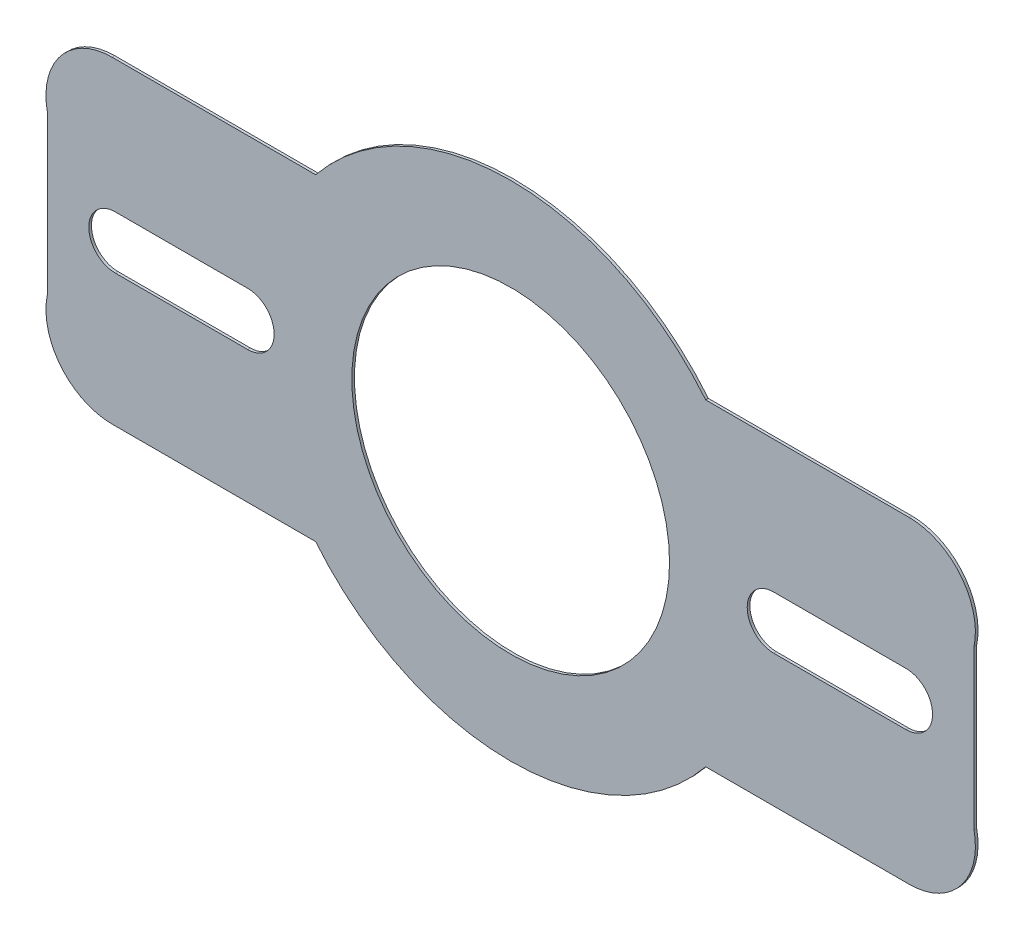
ISO-10303-21;
HEADER;
FILE_DESCRIPTION(('STEP AP214'),'2;1');
FILE_NAME('part.step','',(''),(''),'','','');
FILE_SCHEMA(('AUTOMOTIVE_DESIGN { 1 0 10303 214 1 1 1 1 }'));
ENDSEC;
DATA;
#1=APPLICATION_CONTEXT('core data for automotive mechanical design processes');
#2=APPLICATION_PROTOCOL_DEFINITION('international standard','automotive_design',2000,#1);
#3=PRODUCT_CONTEXT('',#1,'mechanical');
#4=PRODUCT('Part','Part','',(#3));
#5=PRODUCT_RELATED_PRODUCT_CATEGORY('part','',(#4));
#6=PRODUCT_DEFINITION_FORMATION('','',#4);
#7=PRODUCT_DEFINITION_CONTEXT('part definition',#1,'design');
#8=PRODUCT_DEFINITION('design','',#6,#7);
#9=PRODUCT_DEFINITION_SHAPE('','',#8);
#10=(LENGTH_UNIT() NAMED_UNIT(*) SI_UNIT(.MILLI.,.METRE.));
#11=(NAMED_UNIT(*) PLANE_ANGLE_UNIT() SI_UNIT($,.RADIAN.));
#12=(NAMED_UNIT(*) SI_UNIT($,.STERADIAN.) SOLID_ANGLE_UNIT());
#13=UNCERTAINTY_MEASURE_WITH_UNIT(LENGTH_MEASURE(1.E-05),#10,'distance_accuracy_value','');
#14=(GEOMETRIC_REPRESENTATION_CONTEXT(3) GLOBAL_UNCERTAINTY_ASSIGNED_CONTEXT((#13)) GLOBAL_UNIT_ASSIGNED_CONTEXT((#10,
#11,#12)) REPRESENTATION_CONTEXT('',''));
#15=CARTESIAN_POINT('',(0.,0.,0.));
#16=DIRECTION('',(0.,0.,1.));
#17=DIRECTION('',(1.,0.,0.));
#18=AXIS2_PLACEMENT_3D('',#15,#16,#17);
#19=CARTESIAN_POINT('',(0.,0.,1.));
#20=DIRECTION('',(0.,0.,1.));
#21=DIRECTION('',(1.,0.,0.));
#22=AXIS2_PLACEMENT_3D('',#19,#20,#21);
#23=PLANE('',#22);
#24=CARTESIAN_POINT('',(0.,0.,1.));
#25=DIRECTION('',(0.,0.,1.));
#26=DIRECTION('',(1.,0.,0.));
#27=AXIS2_PLACEMENT_3D('',#24,#25,#26);
#28=CIRCLE('',#27,95.);
#29=CARTESIAN_POINT('',(73.6545993132812,60.0000000000001,1.));
#30=VERTEX_POINT('',#29);
#31=CARTESIAN_POINT('',(-73.6545993132812,60.,1.));
#32=VERTEX_POINT('',#31);
#33=EDGE_CURVE('E247',#30,#32,#28,.T.);
#34=ORIENTED_EDGE('',*,*,#33,.T.);
#35=DIRECTION('',(-1.,0.,0.));
#36=VECTOR('',#35,1.);
#37=CARTESIAN_POINT('',(-73.6545993132812,60.,1.));
#38=LINE('',#37,#36);
#39=CARTESIAN_POINT('',(-150.505102572168,60.,1.));
#40=VERTEX_POINT('',#39);
#41=EDGE_CURVE('E250',#32,#40,#38,.T.);
#42=ORIENTED_EDGE('',*,*,#41,.T.);
#43=CARTESIAN_POINT('',(-150.505102572168,35.,1.));
#44=DIRECTION('',(0.,0.,1.));
#45=DIRECTION('',(1.,0.,0.));
#46=AXIS2_PLACEMENT_3D('',#43,#44,#45);
#47=CIRCLE('',#46,25.);
#48=CARTESIAN_POINT('',(-175.,30.,1.));
#49=VERTEX_POINT('',#48);
#50=EDGE_CURVE('E253',#40,#49,#47,.T.);
#51=ORIENTED_EDGE('',*,*,#50,.T.);
#52=DIRECTION('',(0.,-1.,0.));
#53=VECTOR('',#52,1.);
#54=CARTESIAN_POINT('',(-175.,30.,1.));
#55=LINE('',#54,#53);
#56=CARTESIAN_POINT('',(-175.,-30.,1.));
#57=VERTEX_POINT('',#56);
#58=EDGE_CURVE('E255',#49,#57,#55,.T.);
#59=ORIENTED_EDGE('',*,*,#58,.T.);
#60=CARTESIAN_POINT('',(-150.505102572168,-35.,1.));
#61=DIRECTION('',(0.,0.,1.));
#62=DIRECTION('',(-1.,0.,0.));
#63=AXIS2_PLACEMENT_3D('',#60,#61,#62);
#64=CIRCLE('',#63,25.);
#65=CARTESIAN_POINT('',(-150.505102572168,-60.,1.));
#66=VERTEX_POINT('',#65);
#67=EDGE_CURVE('E257',#57,#66,#64,.T.);
#68=ORIENTED_EDGE('',*,*,#67,.T.);
#69=DIRECTION('',(1.,0.,0.));
#70=VECTOR('',#69,1.);
#71=CARTESIAN_POINT('',(-73.6545993132812,-60.,1.));
#72=LINE('',#71,#70);
#73=CARTESIAN_POINT('',(-73.6545993132812,-60.,1.));
#74=VERTEX_POINT('',#73);
#75=EDGE_CURVE('E259',#66,#74,#72,.T.);
#76=ORIENTED_EDGE('',*,*,#75,.T.);
#77=CARTESIAN_POINT('',(0.,0.,1.));
#78=DIRECTION('',(0.,0.,1.));
#79=DIRECTION('',(1.,0.,0.));
#80=AXIS2_PLACEMENT_3D('',#77,#78,#79);
#81=CIRCLE('',#80,95.);
#82=CARTESIAN_POINT('',(73.6545993132812,-59.9999999999999,1.));
#83=VERTEX_POINT('',#82);
#84=EDGE_CURVE('E261',#74,#83,#81,.T.);
#85=ORIENTED_EDGE('',*,*,#84,.T.);
#86=DIRECTION('',(1.,0.,0.));
#87=VECTOR('',#86,1.);
#88=CARTESIAN_POINT('',(73.6545993132812,-59.9999999999999,1.));
#89=LINE('',#88,#87);
#90=CARTESIAN_POINT('',(150.505102572168,-59.9999999999999,1.));
#91=VERTEX_POINT('',#90);
#92=EDGE_CURVE('E263',#83,#91,#89,.T.);
#93=ORIENTED_EDGE('',*,*,#92,.T.);
#94=CARTESIAN_POINT('',(150.505102572168,-34.9999999999999,1.));
#95=DIRECTION('',(0.,0.,1.));
#96=DIRECTION('',(1.,0.,0.));
#97=AXIS2_PLACEMENT_3D('',#94,#95,#96);
#98=CIRCLE('',#97,25.);
#99=CARTESIAN_POINT('',(175.,-29.9999999999999,1.));
#100=VERTEX_POINT('',#99);
#101=EDGE_CURVE('E265',#91,#100,#98,.T.);
#102=ORIENTED_EDGE('',*,*,#101,.T.);
#103=DIRECTION('',(0.,1.,0.));
#104=VECTOR('',#103,1.);
#105=CARTESIAN_POINT('',(175.,30.0000000000001,1.));
#106=LINE('',#105,#104);
#107=CARTESIAN_POINT('',(175.,30.0000000000001,1.));
#108=VERTEX_POINT('',#107);
#109=EDGE_CURVE('E267',#100,#108,#106,.T.);
#110=ORIENTED_EDGE('',*,*,#109,.T.);
#111=CARTESIAN_POINT('',(150.505102572168,35.0000000000001,1.));
#112=DIRECTION('',(0.,0.,1.));
#113=DIRECTION('',(-1.,0.,0.));
#114=AXIS2_PLACEMENT_3D('',#111,#112,#113);
#115=CIRCLE('',#114,25.);
#116=CARTESIAN_POINT('',(150.505102572168,60.0000000000001,1.));
#117=VERTEX_POINT('',#116);
#118=EDGE_CURVE('E269',#108,#117,#115,.T.);
#119=ORIENTED_EDGE('',*,*,#118,.T.);
#120=DIRECTION('',(-1.,0.,0.));
#121=VECTOR('',#120,1.);
#122=CARTESIAN_POINT('',(73.6545993132812,60.0000000000001,1.));
#123=LINE('',#122,#121);
#124=EDGE_CURVE('E271',#117,#30,#123,.T.);
#125=ORIENTED_EDGE('',*,*,#124,.T.);
#126=EDGE_LOOP('',(#34,#42,#51,#59,#68,#76,#85,#93,#102,#110,#119,#125));
#127=FACE_BOUND('',#126,.T.);
#128=CARTESIAN_POINT('',(0.,0.,1.));
#129=DIRECTION('',(0.,0.,1.));
#130=DIRECTION('',(1.,0.,0.));
#131=AXIS2_PLACEMENT_3D('',#128,#129,#130);
#132=CIRCLE('',#131,60.);
#133=CARTESIAN_POINT('',(60.,0.,1.));
#134=VERTEX_POINT('',#133);
#135=EDGE_CURVE('E241',#134,#134,#132,.T.);
#136=ORIENTED_EDGE('',*,*,#135,.F.);
#137=EDGE_LOOP('',(#136));
#138=FACE_BOUND('',#137,.T.);
#139=DIRECTION('',(-1.,0.,0.));
#140=VECTOR('',#139,1.);
#141=CARTESIAN_POINT('',(-149.327299656641,9.99999999999998,1.));
#142=LINE('',#141,#140);
#143=CARTESIAN_POINT('',(-99.3272996566406,9.99999999999998,1.));
#144=VERTEX_POINT('',#143);
#145=CARTESIAN_POINT('',(-149.327299656641,9.99999999999998,1.));
#146=VERTEX_POINT('',#145);
#147=EDGE_CURVE('E212',#144,#146,#142,.T.);
#148=ORIENTED_EDGE('',*,*,#147,.F.);
#149=CARTESIAN_POINT('',(-99.3272996566406,0.,1.));
#150=DIRECTION('',(0.,0.,1.));
#151=DIRECTION('',(-1.,0.,0.));
#152=AXIS2_PLACEMENT_3D('',#149,#150,#151);
#153=CIRCLE('',#152,9.99999999999999);
#154=CARTESIAN_POINT('',(-99.3272996566406,-10.,1.));
#155=VERTEX_POINT('',#154);
#156=EDGE_CURVE('E210',#155,#144,#153,.T.);
#157=ORIENTED_EDGE('',*,*,#156,.F.);
#158=DIRECTION('',(1.,0.,0.));
#159=VECTOR('',#158,1.);
#160=CARTESIAN_POINT('',(-149.327299656641,-10.,1.));
#161=LINE('',#160,#159);
#162=CARTESIAN_POINT('',(-149.327299656641,-10.,1.));
#163=VERTEX_POINT('',#162);
#164=EDGE_CURVE('E218',#163,#155,#161,.T.);
#165=ORIENTED_EDGE('',*,*,#164,.F.);
#166=CARTESIAN_POINT('',(-149.327299656641,0.,1.));
#167=DIRECTION('',(0.,0.,1.));
#168=DIRECTION('',(1.,0.,0.));
#169=AXIS2_PLACEMENT_3D('',#166,#167,#168);
#170=CIRCLE('',#169,9.99999999999999);
#171=EDGE_CURVE('E215',#146,#163,#170,.T.);
#172=ORIENTED_EDGE('',*,*,#171,.F.);
#173=EDGE_LOOP('',(#148,#157,#165,#172));
#174=FACE_BOUND('',#173,.T.);
#175=DIRECTION('',(1.,0.,0.));
#176=VECTOR('',#175,1.);
#177=CARTESIAN_POINT('',(149.327299656641,-9.9999999999999,1.));
#178=LINE('',#177,#176);
#179=CARTESIAN_POINT('',(99.3272996566406,-9.9999999999999,1.));
#180=VERTEX_POINT('',#179);
#181=CARTESIAN_POINT('',(149.327299656641,-9.9999999999999,1.));
#182=VERTEX_POINT('',#181);
#183=EDGE_CURVE('E182',#180,#182,#178,.T.);
#184=ORIENTED_EDGE('',*,*,#183,.F.);
#185=CARTESIAN_POINT('',(99.3272996566406,0.,1.));
#186=DIRECTION('',(0.,0.,1.));
#187=DIRECTION('',(1.,0.,0.));
#188=AXIS2_PLACEMENT_3D('',#185,#186,#187);
#189=CIRCLE('',#188,9.99999999999999);
#190=CARTESIAN_POINT('',(99.3272996566406,10.0000000000001,1.));
#191=VERTEX_POINT('',#190);
#192=EDGE_CURVE('E174',#191,#180,#189,.T.);
#193=ORIENTED_EDGE('',*,*,#192,.F.);
#194=DIRECTION('',(-1.,0.,0.));
#195=VECTOR('',#194,1.);
#196=CARTESIAN_POINT('',(149.327299656641,10.0000000000001,1.));
#197=LINE('',#196,#195);
#198=CARTESIAN_POINT('',(149.327299656641,10.0000000000001,1.));
#199=VERTEX_POINT('',#198);
#200=EDGE_CURVE('E196',#199,#191,#197,.T.);
#201=ORIENTED_EDGE('',*,*,#200,.F.);
#202=CARTESIAN_POINT('',(149.327299656641,0.,1.));
#203=DIRECTION('',(0.,0.,1.));
#204=DIRECTION('',(-1.,0.,0.));
#205=AXIS2_PLACEMENT_3D('',#202,#203,#204);
#206=CIRCLE('',#205,9.99999999999999);
#207=EDGE_CURVE('E194',#182,#199,#206,.T.);
#208=ORIENTED_EDGE('',*,*,#207,.F.);
#209=EDGE_LOOP('',(#184,#193,#201,#208));
#210=FACE_BOUND('',#209,.T.);
#211=ADVANCED_FACE('F37',(#127,#138,#174,#210),#23,.T.);
#212=CARTESIAN_POINT('',(0.,0.,0.));
#213=DIRECTION('',(0.,0.,1.));
#214=DIRECTION('',(1.,0.,0.));
#215=AXIS2_PLACEMENT_3D('',#212,#213,#214);
#216=PLANE('',#215);
#217=CARTESIAN_POINT('',(-99.3272996566406,0.,0.));
#218=DIRECTION('',(0.,0.,1.));
#219=DIRECTION('',(-1.,0.,0.));
#220=AXIS2_PLACEMENT_3D('',#217,#218,#219);
#221=CIRCLE('',#220,9.99999999999999);
#222=CARTESIAN_POINT('',(-99.3272996566406,-10.,0.));
#223=VERTEX_POINT('',#222);
#224=CARTESIAN_POINT('',(-99.3272996566406,9.99999999999998,0.));
#225=VERTEX_POINT('',#224);
#226=EDGE_CURVE('E190',#223,#225,#221,.T.);
#227=ORIENTED_EDGE('',*,*,#226,.T.);
#228=DIRECTION('',(-1.,0.,0.));
#229=VECTOR('',#228,1.);
#230=CARTESIAN_POINT('',(-149.327299656641,9.99999999999998,0.));
#231=LINE('',#230,#229);
#232=CARTESIAN_POINT('',(-149.327299656641,9.99999999999998,0.));
#233=VERTEX_POINT('',#232);
#234=EDGE_CURVE('E223',#225,#233,#231,.T.);
#235=ORIENTED_EDGE('',*,*,#234,.T.);
#236=CARTESIAN_POINT('',(-149.327299656641,0.,0.));
#237=DIRECTION('',(0.,0.,1.));
#238=DIRECTION('',(1.,0.,0.));
#239=AXIS2_PLACEMENT_3D('',#236,#237,#238);
#240=CIRCLE('',#239,9.99999999999999);
#241=CARTESIAN_POINT('',(-149.327299656641,-10.,0.));
#242=VERTEX_POINT('',#241);
#243=EDGE_CURVE('E226',#233,#242,#240,.T.);
#244=ORIENTED_EDGE('',*,*,#243,.T.);
#245=DIRECTION('',(1.,0.,0.));
#246=VECTOR('',#245,1.);
#247=CARTESIAN_POINT('',(-149.327299656641,-10.,0.));
#248=LINE('',#247,#246);
#249=EDGE_CURVE('E213',#242,#223,#248,.T.);
#250=ORIENTED_EDGE('',*,*,#249,.T.);
#251=EDGE_LOOP('',(#227,#235,#244,#250));
#252=FACE_BOUND('',#251,.T.);
#253=CARTESIAN_POINT('',(0.,0.,0.));
#254=DIRECTION('',(0.,0.,1.));
#255=DIRECTION('',(1.,0.,0.));
#256=AXIS2_PLACEMENT_3D('',#253,#254,#255);
#257=CIRCLE('',#256,95.);
#258=CARTESIAN_POINT('',(73.6545993132812,60.0000000000001,0.));
#259=VERTEX_POINT('',#258);
#260=CARTESIAN_POINT('',(-73.6545993132812,60.,0.));
#261=VERTEX_POINT('',#260);
#262=EDGE_CURVE('E244',#259,#261,#257,.T.);
#263=ORIENTED_EDGE('',*,*,#262,.F.);
#264=DIRECTION('',(-1.,0.,0.));
#265=VECTOR('',#264,1.);
#266=CARTESIAN_POINT('',(73.6545993132812,60.0000000000001,0.));
#267=LINE('',#266,#265);
#268=CARTESIAN_POINT('',(150.505102572168,60.0000000000001,0.));
#269=VERTEX_POINT('',#268);
#270=EDGE_CURVE('E251',#269,#259,#267,.T.);
#271=ORIENTED_EDGE('',*,*,#270,.F.);
#272=CARTESIAN_POINT('',(150.505102572168,35.0000000000001,0.));
#273=DIRECTION('',(0.,0.,1.));
#274=DIRECTION('',(-1.,0.,0.));
#275=AXIS2_PLACEMENT_3D('',#272,#273,#274);
#276=CIRCLE('',#275,25.);
#277=CARTESIAN_POINT('',(175.,30.0000000000001,0.));
#278=VERTEX_POINT('',#277);
#279=EDGE_CURVE('E294',#278,#269,#276,.T.);
#280=ORIENTED_EDGE('',*,*,#279,.F.);
#281=DIRECTION('',(0.,1.,0.));
#282=VECTOR('',#281,1.);
#283=CARTESIAN_POINT('',(175.,30.0000000000001,0.));
#284=LINE('',#283,#282);
#285=CARTESIAN_POINT('',(175.,-29.9999999999999,0.));
#286=VERTEX_POINT('',#285);
#287=EDGE_CURVE('E292',#286,#278,#284,.T.);
#288=ORIENTED_EDGE('',*,*,#287,.F.);
#289=CARTESIAN_POINT('',(150.505102572168,-34.9999999999999,0.));
#290=DIRECTION('',(0.,0.,1.));
#291=DIRECTION('',(1.,0.,0.));
#292=AXIS2_PLACEMENT_3D('',#289,#290,#291);
#293=CIRCLE('',#292,25.);
#294=CARTESIAN_POINT('',(150.505102572168,-59.9999999999999,0.));
#295=VERTEX_POINT('',#294);
#296=EDGE_CURVE('E290',#295,#286,#293,.T.);
#297=ORIENTED_EDGE('',*,*,#296,.F.);
#298=DIRECTION('',(1.,0.,0.));
#299=VECTOR('',#298,1.);
#300=CARTESIAN_POINT('',(73.6545993132812,-59.9999999999999,0.));
#301=LINE('',#300,#299);
#302=CARTESIAN_POINT('',(73.6545993132812,-59.9999999999999,0.));
#303=VERTEX_POINT('',#302);
#304=EDGE_CURVE('E288',#303,#295,#301,.T.);
#305=ORIENTED_EDGE('',*,*,#304,.F.);
#306=CARTESIAN_POINT('',(0.,0.,0.));
#307=DIRECTION('',(0.,0.,1.));
#308=DIRECTION('',(1.,0.,0.));
#309=AXIS2_PLACEMENT_3D('',#306,#307,#308);
#310=CIRCLE('',#309,95.);
#311=CARTESIAN_POINT('',(-73.6545993132812,-60.,0.));
#312=VERTEX_POINT('',#311);
#313=EDGE_CURVE('E286',#312,#303,#310,.T.);
#314=ORIENTED_EDGE('',*,*,#313,.F.);
#315=DIRECTION('',(1.,0.,0.));
#316=VECTOR('',#315,1.);
#317=CARTESIAN_POINT('',(-73.6545993132812,-60.,0.));
#318=LINE('',#317,#316);
#319=CARTESIAN_POINT('',(-150.505102572168,-60.,0.));
#320=VERTEX_POINT('',#319);
#321=EDGE_CURVE('E284',#320,#312,#318,.T.);
#322=ORIENTED_EDGE('',*,*,#321,.F.);
#323=CARTESIAN_POINT('',(-150.505102572168,-35.,0.));
#324=DIRECTION('',(0.,0.,1.));
#325=DIRECTION('',(-1.,0.,0.));
#326=AXIS2_PLACEMENT_3D('',#323,#324,#325);
#327=CIRCLE('',#326,25.);
#328=CARTESIAN_POINT('',(-175.,-30.,0.));
#329=VERTEX_POINT('',#328);
#330=EDGE_CURVE('E282',#329,#320,#327,.T.);
#331=ORIENTED_EDGE('',*,*,#330,.F.);
#332=DIRECTION('',(0.,-1.,0.));
#333=VECTOR('',#332,1.);
#334=CARTESIAN_POINT('',(-175.,30.,0.));
#335=LINE('',#334,#333);
#336=CARTESIAN_POINT('',(-175.,30.,0.));
#337=VERTEX_POINT('',#336);
#338=EDGE_CURVE('E280',#337,#329,#335,.T.);
#339=ORIENTED_EDGE('',*,*,#338,.F.);
#340=CARTESIAN_POINT('',(-150.505102572168,35.,0.));
#341=DIRECTION('',(0.,0.,1.));
#342=DIRECTION('',(1.,0.,0.));
#343=AXIS2_PLACEMENT_3D('',#340,#341,#342);
#344=CIRCLE('',#343,25.);
#345=CARTESIAN_POINT('',(-150.505102572168,60.,0.));
#346=VERTEX_POINT('',#345);
#347=EDGE_CURVE('E278',#346,#337,#344,.T.);
#348=ORIENTED_EDGE('',*,*,#347,.F.);
#349=DIRECTION('',(-1.,0.,0.));
#350=VECTOR('',#349,1.);
#351=CARTESIAN_POINT('',(-73.6545993132812,60.,0.));
#352=LINE('',#351,#350);
#353=EDGE_CURVE('E276',#261,#346,#352,.T.);
#354=ORIENTED_EDGE('',*,*,#353,.F.);
#355=EDGE_LOOP('',(#263,#271,#280,#288,#297,#305,#314,#322,#331,#339,#348,#354));
#356=FACE_BOUND('',#355,.T.);
#357=CARTESIAN_POINT('',(0.,0.,0.));
#358=DIRECTION('',(0.,0.,1.));
#359=DIRECTION('',(1.,0.,0.));
#360=AXIS2_PLACEMENT_3D('',#357,#358,#359);
#361=CIRCLE('',#360,60.);
#362=CARTESIAN_POINT('',(60.,0.,0.));
#363=VERTEX_POINT('',#362);
#364=EDGE_CURVE('E240',#363,#363,#361,.T.);
#365=ORIENTED_EDGE('',*,*,#364,.T.);
#366=EDGE_LOOP('',(#365));
#367=FACE_BOUND('',#366,.T.);
#368=CARTESIAN_POINT('',(99.3272996566406,0.,0.));
#369=DIRECTION('',(0.,0.,1.));
#370=DIRECTION('',(1.,0.,0.));
#371=AXIS2_PLACEMENT_3D('',#368,#369,#370);
#372=CIRCLE('',#371,9.99999999999999);
#373=CARTESIAN_POINT('',(99.3272996566406,10.0000000000001,0.));
#374=VERTEX_POINT('',#373);
#375=CARTESIAN_POINT('',(99.3272996566406,-9.9999999999999,0.));
#376=VERTEX_POINT('',#375);
#377=EDGE_CURVE('E60',#374,#376,#372,.T.);
#378=ORIENTED_EDGE('',*,*,#377,.T.);
#379=DIRECTION('',(1.,0.,0.));
#380=VECTOR('',#379,1.);
#381=CARTESIAN_POINT('',(149.327299656641,-9.9999999999999,0.));
#382=LINE('',#381,#380);
#383=CARTESIAN_POINT('',(149.327299656641,-9.9999999999999,0.));
#384=VERTEX_POINT('',#383);
#385=EDGE_CURVE('E189',#376,#384,#382,.T.);
#386=ORIENTED_EDGE('',*,*,#385,.T.);
#387=CARTESIAN_POINT('',(149.327299656641,0.,0.));
#388=DIRECTION('',(0.,0.,1.));
#389=DIRECTION('',(-1.,0.,0.));
#390=AXIS2_PLACEMENT_3D('',#387,#388,#389);
#391=CIRCLE('',#390,9.99999999999999);
#392=CARTESIAN_POINT('',(149.327299656641,10.0000000000001,0.));
#393=VERTEX_POINT('',#392);
#394=EDGE_CURVE('E202',#384,#393,#391,.T.);
#395=ORIENTED_EDGE('',*,*,#394,.T.);
#396=DIRECTION('',(-1.,0.,0.));
#397=VECTOR('',#396,1.);
#398=CARTESIAN_POINT('',(149.327299656641,10.0000000000001,0.));
#399=LINE('',#398,#397);
#400=EDGE_CURVE('E183',#393,#374,#399,.T.);
#401=ORIENTED_EDGE('',*,*,#400,.T.);
#402=EDGE_LOOP('',(#378,#386,#395,#401));
#403=FACE_BOUND('',#402,.T.);
#404=ADVANCED_FACE('F336',(#252,#356,#367,#403),#216,.F.);
#405=CARTESIAN_POINT('',(0.,0.,1.));
#406=DIRECTION('',(0.,0.,-1.));
#407=DIRECTION('',(-1.,0.,0.));
#408=AXIS2_PLACEMENT_3D('',#405,#406,#407);
#409=CYLINDRICAL_SURFACE('',#408,95.);
#410=ORIENTED_EDGE('',*,*,#262,.T.);
#411=DIRECTION('',(0.,0.,-1.));
#412=VECTOR('',#411,1.);
#413=CARTESIAN_POINT('',(-73.6545993132812,60.,1.));
#414=LINE('',#413,#412);
#415=EDGE_CURVE('E11',#32,#261,#414,.T.);
#416=ORIENTED_EDGE('',*,*,#415,.F.);
#417=ORIENTED_EDGE('',*,*,#33,.F.);
#418=DIRECTION('',(0.,0.,-1.));
#419=VECTOR('',#418,1.);
#420=CARTESIAN_POINT('',(73.6545993132812,60.0000000000001,1.));
#421=LINE('',#420,#419);
#422=EDGE_CURVE('E273',#30,#259,#421,.T.);
#423=ORIENTED_EDGE('',*,*,#422,.T.);
#424=EDGE_LOOP('',(#410,#416,#417,#423));
#425=FACE_BOUND('',#424,.T.);
#426=ADVANCED_FACE('F39',(#425),#409,.T.);
#427=CARTESIAN_POINT('',(-73.6545993132812,60.,1.));
#428=DIRECTION('',(0.,-1.,0.));
#429=DIRECTION('',(1.,0.,0.));
#430=AXIS2_PLACEMENT_3D('',#427,#428,#429);
#431=PLANE('',#430);
#432=ORIENTED_EDGE('',*,*,#353,.T.);
#433=DIRECTION('',(0.,0.,-1.));
#434=VECTOR('',#433,1.);
#435=CARTESIAN_POINT('',(-150.505102572168,60.,1.));
#436=LINE('',#435,#434);
#437=EDGE_CURVE('E45',#40,#346,#436,.T.);
#438=ORIENTED_EDGE('',*,*,#437,.F.);
#439=ORIENTED_EDGE('',*,*,#41,.F.);
#440=ORIENTED_EDGE('',*,*,#415,.T.);
#441=EDGE_LOOP('',(#432,#438,#439,#440));
#442=FACE_BOUND('',#441,.T.);
#443=ADVANCED_FACE('F354',(#442),#431,.F.);
#444=CARTESIAN_POINT('',(-150.505102572168,35.,1.));
#445=DIRECTION('',(0.,0.,-1.));
#446=DIRECTION('',(-1.,0.,0.));
#447=AXIS2_PLACEMENT_3D('',#444,#445,#446);
#448=CYLINDRICAL_SURFACE('',#447,25.);
#449=ORIENTED_EDGE('',*,*,#347,.T.);
#450=DIRECTION('',(0.,0.,-1.));
#451=VECTOR('',#450,1.);
#452=CARTESIAN_POINT('',(-175.,30.,1.));
#453=LINE('',#452,#451);
#454=EDGE_CURVE('E323',#49,#337,#453,.T.);
#455=ORIENTED_EDGE('',*,*,#454,.F.);
#456=ORIENTED_EDGE('',*,*,#50,.F.);
#457=ORIENTED_EDGE('',*,*,#437,.T.);
#458=EDGE_LOOP('',(#449,#455,#456,#457));
#459=FACE_BOUND('',#458,.T.);
#460=ADVANCED_FACE('F330',(#459),#448,.T.);
#461=CARTESIAN_POINT('',(-175.,30.,1.));
#462=DIRECTION('',(1.,0.,0.));
#463=DIRECTION('',(0.,0.,-1.));
#464=AXIS2_PLACEMENT_3D('',#461,#462,#463);
#465=PLANE('',#464);
#466=ORIENTED_EDGE('',*,*,#338,.T.);
#467=DIRECTION('',(0.,0.,-1.));
#468=VECTOR('',#467,1.);
#469=CARTESIAN_POINT('',(-175.,-30.,1.));
#470=LINE('',#469,#468);
#471=EDGE_CURVE('E320',#57,#329,#470,.T.);
#472=ORIENTED_EDGE('',*,*,#471,.F.);
#473=ORIENTED_EDGE('',*,*,#58,.F.);
#474=ORIENTED_EDGE('',*,*,#454,.T.);
#475=EDGE_LOOP('',(#466,#472,#473,#474));
#476=FACE_BOUND('',#475,.T.);
#477=ADVANCED_FACE('F342',(#476),#465,.F.);
#478=CARTESIAN_POINT('',(-150.505102572168,-35.,1.));
#479=DIRECTION('',(0.,0.,-1.));
#480=DIRECTION('',(-1.,0.,0.));
#481=AXIS2_PLACEMENT_3D('',#478,#479,#480);
#482=CYLINDRICAL_SURFACE('',#481,25.);
#483=ORIENTED_EDGE('',*,*,#330,.T.);
#484=DIRECTION('',(0.,0.,-1.));
#485=VECTOR('',#484,1.);
#486=CARTESIAN_POINT('',(-150.505102572168,-60.,1.));
#487=LINE('',#486,#485);
#488=EDGE_CURVE('E317',#66,#320,#487,.T.);
#489=ORIENTED_EDGE('',*,*,#488,.F.);
#490=ORIENTED_EDGE('',*,*,#67,.F.);
#491=ORIENTED_EDGE('',*,*,#471,.T.);
#492=EDGE_LOOP('',(#483,#489,#490,#491));
#493=FACE_BOUND('',#492,.T.);
#494=ADVANCED_FACE('F346',(#493),#482,.T.);
#495=CARTESIAN_POINT('',(-73.6545993132812,-60.,1.));
#496=DIRECTION('',(0.,1.,0.));
#497=DIRECTION('',(-1.,0.,0.));
#498=AXIS2_PLACEMENT_3D('',#495,#496,#497);
#499=PLANE('',#498);
#500=ORIENTED_EDGE('',*,*,#321,.T.);
#501=DIRECTION('',(0.,0.,-1.));
#502=VECTOR('',#501,1.);
#503=CARTESIAN_POINT('',(-73.6545993132812,-60.,1.));
#504=LINE('',#503,#502);
#505=EDGE_CURVE('E314',#74,#312,#504,.T.);
#506=ORIENTED_EDGE('',*,*,#505,.F.);
#507=ORIENTED_EDGE('',*,*,#75,.F.);
#508=ORIENTED_EDGE('',*,*,#488,.T.);
#509=EDGE_LOOP('',(#500,#506,#507,#508));
#510=FACE_BOUND('',#509,.T.);
#511=ADVANCED_FACE('F387',(#510),#499,.F.);
#512=CARTESIAN_POINT('',(0.,0.,1.));
#513=DIRECTION('',(0.,0.,-1.));
#514=DIRECTION('',(-1.,0.,0.));
#515=AXIS2_PLACEMENT_3D('',#512,#513,#514);
#516=CYLINDRICAL_SURFACE('',#515,95.);
#517=ORIENTED_EDGE('',*,*,#313,.T.);
#518=DIRECTION('',(0.,0.,-1.));
#519=VECTOR('',#518,1.);
#520=CARTESIAN_POINT('',(73.6545993132812,-59.9999999999999,1.));
#521=LINE('',#520,#519);
#522=EDGE_CURVE('E311',#83,#303,#521,.T.);
#523=ORIENTED_EDGE('',*,*,#522,.F.);
#524=ORIENTED_EDGE('',*,*,#84,.F.);
#525=ORIENTED_EDGE('',*,*,#505,.T.);
#526=EDGE_LOOP('',(#517,#523,#524,#525));
#527=FACE_BOUND('',#526,.T.);
#528=ADVANCED_FACE('F385',(#527),#516,.T.);
#529=CARTESIAN_POINT('',(73.6545993132812,-59.9999999999999,1.));
#530=DIRECTION('',(0.,1.,0.));
#531=DIRECTION('',(-1.,0.,0.));
#532=AXIS2_PLACEMENT_3D('',#529,#530,#531);
#533=PLANE('',#532);
#534=ORIENTED_EDGE('',*,*,#304,.T.);
#535=DIRECTION('',(0.,0.,-1.));
#536=VECTOR('',#535,1.);
#537=CARTESIAN_POINT('',(150.505102572168,-59.9999999999999,1.));
#538=LINE('',#537,#536);
#539=EDGE_CURVE('E308',#91,#295,#538,.T.);
#540=ORIENTED_EDGE('',*,*,#539,.F.);
#541=ORIENTED_EDGE('',*,*,#92,.F.);
#542=ORIENTED_EDGE('',*,*,#522,.T.);
#543=EDGE_LOOP('',(#534,#540,#541,#542));
#544=FACE_BOUND('',#543,.T.);
#545=ADVANCED_FACE('F381',(#544),#533,.F.);
#546=CARTESIAN_POINT('',(150.505102572168,-34.9999999999999,1.));
#547=DIRECTION('',(0.,0.,-1.));
#548=DIRECTION('',(-1.,0.,0.));
#549=AXIS2_PLACEMENT_3D('',#546,#547,#548);
#550=CYLINDRICAL_SURFACE('',#549,25.);
#551=ORIENTED_EDGE('',*,*,#296,.T.);
#552=DIRECTION('',(0.,0.,-1.));
#553=VECTOR('',#552,1.);
#554=CARTESIAN_POINT('',(175.,-29.9999999999999,1.));
#555=LINE('',#554,#553);
#556=EDGE_CURVE('E305',#100,#286,#555,.T.);
#557=ORIENTED_EDGE('',*,*,#556,.F.);
#558=ORIENTED_EDGE('',*,*,#101,.F.);
#559=ORIENTED_EDGE('',*,*,#539,.T.);
#560=EDGE_LOOP('',(#551,#557,#558,#559));
#561=FACE_BOUND('',#560,.T.);
#562=ADVANCED_FACE('F376',(#561),#550,.T.);
#563=CARTESIAN_POINT('',(175.,30.0000000000001,1.));
#564=DIRECTION('',(-1.,0.,0.));
#565=DIRECTION('',(0.,0.,1.));
#566=AXIS2_PLACEMENT_3D('',#563,#564,#565);
#567=PLANE('',#566);
#568=ORIENTED_EDGE('',*,*,#287,.T.);
#569=DIRECTION('',(0.,0.,-1.));
#570=VECTOR('',#569,1.);
#571=CARTESIAN_POINT('',(175.,30.0000000000001,1.));
#572=LINE('',#571,#570);
#573=EDGE_CURVE('E302',#108,#278,#572,.T.);
#574=ORIENTED_EDGE('',*,*,#573,.F.);
#575=ORIENTED_EDGE('',*,*,#109,.F.);
#576=ORIENTED_EDGE('',*,*,#556,.T.);
#577=EDGE_LOOP('',(#568,#574,#575,#576));
#578=FACE_BOUND('',#577,.T.);
#579=ADVANCED_FACE('F370',(#578),#567,.F.);
#580=CARTESIAN_POINT('',(150.505102572168,35.0000000000001,1.));
#581=DIRECTION('',(0.,0.,-1.));
#582=DIRECTION('',(-1.,0.,0.));
#583=AXIS2_PLACEMENT_3D('',#580,#581,#582);
#584=CYLINDRICAL_SURFACE('',#583,25.);
#585=ORIENTED_EDGE('',*,*,#279,.T.);
#586=DIRECTION('',(0.,0.,-1.));
#587=VECTOR('',#586,1.);
#588=CARTESIAN_POINT('',(150.505102572168,60.0000000000001,1.));
#589=LINE('',#588,#587);
#590=EDGE_CURVE('E299',#117,#269,#589,.T.);
#591=ORIENTED_EDGE('',*,*,#590,.F.);
#592=ORIENTED_EDGE('',*,*,#118,.F.);
#593=ORIENTED_EDGE('',*,*,#573,.T.);
#594=EDGE_LOOP('',(#585,#591,#592,#593));
#595=FACE_BOUND('',#594,.T.);
#596=ADVANCED_FACE('F366',(#595),#584,.T.);
#597=CARTESIAN_POINT('',(73.6545993132812,60.0000000000001,1.));
#598=DIRECTION('',(0.,-1.,0.));
#599=DIRECTION('',(1.,0.,0.));
#600=AXIS2_PLACEMENT_3D('',#597,#598,#599);
#601=PLANE('',#600);
#602=ORIENTED_EDGE('',*,*,#270,.T.);
#603=ORIENTED_EDGE('',*,*,#422,.F.);
#604=ORIENTED_EDGE('',*,*,#124,.F.);
#605=ORIENTED_EDGE('',*,*,#590,.T.);
#606=EDGE_LOOP('',(#602,#603,#604,#605));
#607=FACE_BOUND('',#606,.T.);
#608=ADVANCED_FACE('F361',(#607),#601,.F.);
#609=CARTESIAN_POINT('',(0.,0.,1.));
#610=DIRECTION('',(0.,0.,-1.));
#611=DIRECTION('',(-1.,0.,0.));
#612=AXIS2_PLACEMENT_3D('',#609,#610,#611);
#613=CYLINDRICAL_SURFACE('',#612,60.);
#614=ORIENTED_EDGE('',*,*,#135,.T.);
#615=EDGE_LOOP('',(#614));
#616=FACE_BOUND('',#615,.T.);
#617=ORIENTED_EDGE('',*,*,#364,.F.);
#618=EDGE_LOOP('',(#617));
#619=FACE_BOUND('',#618,.T.);
#620=ADVANCED_FACE('F404',(#616,#619),#613,.F.);
#621=CARTESIAN_POINT('',(-99.3272996566406,0.,1.));
#622=DIRECTION('',(0.,0.,-1.));
#623=DIRECTION('',(-1.,0.,0.));
#624=AXIS2_PLACEMENT_3D('',#621,#622,#623);
#625=CYLINDRICAL_SURFACE('',#624,9.99999999999999);
#626=ORIENTED_EDGE('',*,*,#226,.F.);
#627=DIRECTION('',(0.,0.,-1.));
#628=VECTOR('',#627,1.);
#629=CARTESIAN_POINT('',(-99.3272996566406,-10.,1.));
#630=LINE('',#629,#628);
#631=EDGE_CURVE('E220',#155,#223,#630,.T.);
#632=ORIENTED_EDGE('',*,*,#631,.F.);
#633=ORIENTED_EDGE('',*,*,#156,.T.);
#634=DIRECTION('',(0.,0.,-1.));
#635=VECTOR('',#634,1.);
#636=CARTESIAN_POINT('',(-99.3272996566406,9.99999999999998,1.));
#637=LINE('',#636,#635);
#638=EDGE_CURVE('E237',#144,#225,#637,.T.);
#639=ORIENTED_EDGE('',*,*,#638,.T.);
#640=EDGE_LOOP('',(#626,#632,#633,#639));
#641=FACE_BOUND('',#640,.T.);
#642=ADVANCED_FACE('F442',(#641),#625,.F.);
#643=CARTESIAN_POINT('',(-149.327299656641,9.99999999999998,1.));
#644=DIRECTION('',(0.,-1.,0.));
#645=DIRECTION('',(0.,0.,-1.));
#646=AXIS2_PLACEMENT_3D('',#643,#644,#645);
#647=PLANE('',#646);
#648=ORIENTED_EDGE('',*,*,#234,.F.);
#649=ORIENTED_EDGE('',*,*,#638,.F.);
#650=ORIENTED_EDGE('',*,*,#147,.T.);
#651=DIRECTION('',(0.,0.,-1.));
#652=VECTOR('',#651,1.);
#653=CARTESIAN_POINT('',(-149.327299656641,9.99999999999998,1.));
#654=LINE('',#653,#652);
#655=EDGE_CURVE('E235',#146,#233,#654,.T.);
#656=ORIENTED_EDGE('',*,*,#655,.T.);
#657=EDGE_LOOP('',(#648,#649,#650,#656));
#658=FACE_BOUND('',#657,.T.);
#659=ADVANCED_FACE('F449',(#658),#647,.T.);
#660=CARTESIAN_POINT('',(-149.327299656641,0.,1.));
#661=DIRECTION('',(0.,0.,-1.));
#662=DIRECTION('',(-1.,0.,0.));
#663=AXIS2_PLACEMENT_3D('',#660,#661,#662);
#664=CYLINDRICAL_SURFACE('',#663,9.99999999999999);
#665=ORIENTED_EDGE('',*,*,#243,.F.);
#666=ORIENTED_EDGE('',*,*,#655,.F.);
#667=ORIENTED_EDGE('',*,*,#171,.T.);
#668=DIRECTION('',(0.,0.,-1.));
#669=VECTOR('',#668,1.);
#670=CARTESIAN_POINT('',(-149.327299656641,-10.,1.));
#671=LINE('',#670,#669);
#672=EDGE_CURVE('E233',#163,#242,#671,.T.);
#673=ORIENTED_EDGE('',*,*,#672,.T.);
#674=EDGE_LOOP('',(#665,#666,#667,#673));
#675=FACE_BOUND('',#674,.T.);
#676=ADVANCED_FACE('F456',(#675),#664,.F.);
#677=CARTESIAN_POINT('',(-149.327299656641,-10.,1.));
#678=DIRECTION('',(0.,1.,0.));
#679=DIRECTION('',(0.,0.,1.));
#680=AXIS2_PLACEMENT_3D('',#677,#678,#679);
#681=PLANE('',#680);
#682=ORIENTED_EDGE('',*,*,#249,.F.);
#683=ORIENTED_EDGE('',*,*,#672,.F.);
#684=ORIENTED_EDGE('',*,*,#164,.T.);
#685=ORIENTED_EDGE('',*,*,#631,.T.);
#686=EDGE_LOOP('',(#682,#683,#684,#685));
#687=FACE_BOUND('',#686,.T.);
#688=ADVANCED_FACE('F464',(#687),#681,.T.);
#689=CARTESIAN_POINT('',(99.3272996566406,0.,1.));
#690=DIRECTION('',(0.,0.,-1.));
#691=DIRECTION('',(-1.,0.,0.));
#692=AXIS2_PLACEMENT_3D('',#689,#690,#691);
#693=CYLINDRICAL_SURFACE('',#692,9.99999999999999);
#694=ORIENTED_EDGE('',*,*,#377,.F.);
#695=DIRECTION('',(0.,0.,-1.));
#696=VECTOR('',#695,1.);
#697=CARTESIAN_POINT('',(99.3272996566406,10.0000000000001,1.));
#698=LINE('',#697,#696);
#699=EDGE_CURVE('E178',#191,#374,#698,.T.);
#700=ORIENTED_EDGE('',*,*,#699,.F.);
#701=ORIENTED_EDGE('',*,*,#192,.T.);
#702=DIRECTION('',(0.,0.,-1.));
#703=VECTOR('',#702,1.);
#704=CARTESIAN_POINT('',(99.3272996566406,-9.9999999999999,1.));
#705=LINE('',#704,#703);
#706=EDGE_CURVE('E177',#180,#376,#705,.T.);
#707=ORIENTED_EDGE('',*,*,#706,.T.);
#708=EDGE_LOOP('',(#694,#700,#701,#707));
#709=FACE_BOUND('',#708,.T.);
#710=ADVANCED_FACE('F176',(#709),#693,.F.);
#711=CARTESIAN_POINT('',(149.327299656641,-9.9999999999999,1.));
#712=DIRECTION('',(0.,1.,0.));
#713=DIRECTION('',(0.,0.,1.));
#714=AXIS2_PLACEMENT_3D('',#711,#712,#713);
#715=PLANE('',#714);
#716=ORIENTED_EDGE('',*,*,#385,.F.);
#717=ORIENTED_EDGE('',*,*,#706,.F.);
#718=ORIENTED_EDGE('',*,*,#183,.T.);
#719=DIRECTION('',(0.,0.,-1.));
#720=VECTOR('',#719,1.);
#721=CARTESIAN_POINT('',(149.327299656641,-9.9999999999999,1.));
#722=LINE('',#721,#720);
#723=EDGE_CURVE('E191',#182,#384,#722,.T.);
#724=ORIENTED_EDGE('',*,*,#723,.T.);
#725=EDGE_LOOP('',(#716,#717,#718,#724));
#726=FACE_BOUND('',#725,.T.);
#727=ADVANCED_FACE('F186',(#726),#715,.T.);
#728=CARTESIAN_POINT('',(149.327299656641,0.,1.));
#729=DIRECTION('',(0.,0.,-1.));
#730=DIRECTION('',(-1.,0.,0.));
#731=AXIS2_PLACEMENT_3D('',#728,#729,#730);
#732=CYLINDRICAL_SURFACE('',#731,9.99999999999999);
#733=ORIENTED_EDGE('',*,*,#394,.F.);
#734=ORIENTED_EDGE('',*,*,#723,.F.);
#735=ORIENTED_EDGE('',*,*,#207,.T.);
#736=DIRECTION('',(0.,0.,-1.));
#737=VECTOR('',#736,1.);
#738=CARTESIAN_POINT('',(149.327299656641,10.0000000000001,1.));
#739=LINE('',#738,#737);
#740=EDGE_CURVE('E52',#199,#393,#739,.T.);
#741=ORIENTED_EDGE('',*,*,#740,.T.);
#742=EDGE_LOOP('',(#733,#734,#735,#741));
#743=FACE_BOUND('',#742,.T.);
#744=ADVANCED_FACE('F485',(#743),#732,.F.);
#745=CARTESIAN_POINT('',(149.327299656641,10.0000000000001,1.));
#746=DIRECTION('',(0.,-1.,0.));
#747=DIRECTION('',(0.,0.,-1.));
#748=AXIS2_PLACEMENT_3D('',#745,#746,#747);
#749=PLANE('',#748);
#750=ORIENTED_EDGE('',*,*,#400,.F.);
#751=ORIENTED_EDGE('',*,*,#740,.F.);
#752=ORIENTED_EDGE('',*,*,#200,.T.);
#753=ORIENTED_EDGE('',*,*,#699,.T.);
#754=EDGE_LOOP('',(#750,#751,#752,#753));
#755=FACE_BOUND('',#754,.T.);
#756=ADVANCED_FACE('F492',(#755),#749,.T.);
#757=CLOSED_SHELL('',(#211,#404,#426,#443,#460,#477,#494,#511,#528,#545,#562,#579,#596,#608,
#620,#642,#659,#676,#688,#710,#727,#744,#756));
#758=MANIFOLD_SOLID_BREP('B2',#757);
#759=ADVANCED_BREP_SHAPE_REPRESENTATION('',(#18,#758),#14);
#760=SHAPE_DEFINITION_REPRESENTATION(#9,#759);
ENDSEC;
END-ISO-10303-21;
